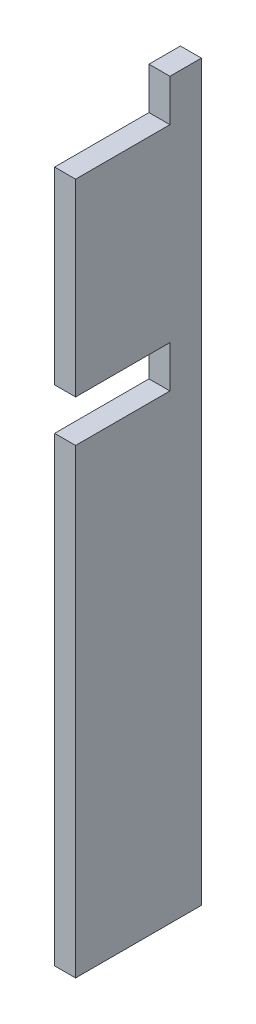
ISO-10303-21;
HEADER;
FILE_DESCRIPTION(('STEP AP214'),'2;1');
FILE_NAME('part.step','',(''),(''),'','','');
FILE_SCHEMA(('AUTOMOTIVE_DESIGN { 1 0 10303 214 1 1 1 1 }'));
ENDSEC;
DATA;
#1=APPLICATION_CONTEXT('core data for automotive mechanical design processes');
#2=APPLICATION_PROTOCOL_DEFINITION('international standard','automotive_design',2000,#1);
#3=PRODUCT_CONTEXT('',#1,'mechanical');
#4=PRODUCT('Part','Part','',(#3));
#5=PRODUCT_RELATED_PRODUCT_CATEGORY('part','',(#4));
#6=PRODUCT_DEFINITION_FORMATION('','',#4);
#7=PRODUCT_DEFINITION_CONTEXT('part definition',#1,'design');
#8=PRODUCT_DEFINITION('design','',#6,#7);
#9=PRODUCT_DEFINITION_SHAPE('','',#8);
#10=(LENGTH_UNIT() NAMED_UNIT(*) SI_UNIT(.MILLI.,.METRE.));
#11=(NAMED_UNIT(*) PLANE_ANGLE_UNIT() SI_UNIT($,.RADIAN.));
#12=(NAMED_UNIT(*) SI_UNIT($,.STERADIAN.) SOLID_ANGLE_UNIT());
#13=UNCERTAINTY_MEASURE_WITH_UNIT(LENGTH_MEASURE(1.E-05),#10,'distance_accuracy_value','');
#14=(GEOMETRIC_REPRESENTATION_CONTEXT(3) GLOBAL_UNCERTAINTY_ASSIGNED_CONTEXT((#13)) GLOBAL_UNIT_ASSIGNED_CONTEXT((#10,
#11,#12)) REPRESENTATION_CONTEXT('',''));
#15=CARTESIAN_POINT('',(0.,0.,0.));
#16=DIRECTION('',(0.,0.,1.));
#17=DIRECTION('',(1.,0.,0.));
#18=AXIS2_PLACEMENT_3D('',#15,#16,#17);
#19=CARTESIAN_POINT('',(1.5875,55.5625,9.52500000000001));
#20=DIRECTION('',(0.,0.,-1.));
#21=DIRECTION('',(0.,1.,0.));
#22=AXIS2_PLACEMENT_3D('',#19,#20,#21);
#23=PLANE('',#22);
#24=DIRECTION('',(0.,-1.,0.));
#25=VECTOR('',#24,1.);
#26=CARTESIAN_POINT('',(-1.5875,55.5625,9.52500000000001));
#27=LINE('',#26,#25);
#28=CARTESIAN_POINT('',(-1.5875,49.2125,9.52500000000001));
#29=VERTEX_POINT('',#28);
#30=CARTESIAN_POINT('',(-1.5875,20.6375,9.52500000000001));
#31=VERTEX_POINT('',#30);
#32=EDGE_CURVE('E131',#29,#31,#27,.T.);
#33=ORIENTED_EDGE('',*,*,#32,.T.);
#34=DIRECTION('',(1.,0.,0.));
#35=VECTOR('',#34,1.);
#36=CARTESIAN_POINT('',(-1.5875,20.6375,9.52500000000001));
#37=LINE('',#36,#35);
#38=CARTESIAN_POINT('',(1.5875,20.6375,9.52500000000001));
#39=VERTEX_POINT('',#38);
#40=EDGE_CURVE('E187',#31,#39,#37,.T.);
#41=ORIENTED_EDGE('',*,*,#40,.T.);
#42=DIRECTION('',(0.,-1.,0.));
#43=VECTOR('',#42,1.);
#44=CARTESIAN_POINT('',(1.5875,55.5625,9.52500000000001));
#45=LINE('',#44,#43);
#46=CARTESIAN_POINT('',(1.5875,49.2125,9.52500000000001));
#47=VERTEX_POINT('',#46);
#48=EDGE_CURVE('E152',#47,#39,#45,.T.);
#49=ORIENTED_EDGE('',*,*,#48,.F.);
#50=DIRECTION('',(1.,0.,0.));
#51=VECTOR('',#50,1.);
#52=CARTESIAN_POINT('',(-1.5875,49.2125,9.52500000000001));
#53=LINE('',#52,#51);
#54=EDGE_CURVE('E166',#29,#47,#53,.T.);
#55=ORIENTED_EDGE('',*,*,#54,.F.);
#56=EDGE_LOOP('',(#33,#41,#49,#55));
#57=FACE_BOUND('',#56,.T.);
#58=ADVANCED_FACE('F31',(#57),#23,.F.);
#59=CARTESIAN_POINT('',(1.5875,55.5625,-9.525));
#60=DIRECTION('',(0.,0.,1.));
#61=DIRECTION('',(0.,-1.,0.));
#62=AXIS2_PLACEMENT_3D('',#59,#60,#61);
#63=PLANE('',#62);
#64=DIRECTION('',(0.,1.,0.));
#65=VECTOR('',#64,1.);
#66=CARTESIAN_POINT('',(-1.5875,55.5625,-9.525));
#67=LINE('',#66,#65);
#68=CARTESIAN_POINT('',(-1.5875,-55.5625,-9.52500000000001));
#69=VERTEX_POINT('',#68);
#70=CARTESIAN_POINT('',(-1.5875,55.5625,-9.525));
#71=VERTEX_POINT('',#70);
#72=EDGE_CURVE('E136',#69,#71,#67,.T.);
#73=ORIENTED_EDGE('',*,*,#72,.T.);
#74=DIRECTION('',(-1.,0.,0.));
#75=VECTOR('',#74,1.);
#76=CARTESIAN_POINT('',(1.5875,55.5625,-9.525));
#77=LINE('',#76,#75);
#78=CARTESIAN_POINT('',(1.5875,55.5625,-9.525));
#79=VERTEX_POINT('',#78);
#80=EDGE_CURVE('E11',#79,#71,#77,.T.);
#81=ORIENTED_EDGE('',*,*,#80,.F.);
#82=DIRECTION('',(0.,1.,0.));
#83=VECTOR('',#82,1.);
#84=CARTESIAN_POINT('',(1.5875,55.5625,-9.525));
#85=LINE('',#84,#83);
#86=CARTESIAN_POINT('',(1.5875,-55.5625,-9.52500000000001));
#87=VERTEX_POINT('',#86);
#88=EDGE_CURVE('E141',#87,#79,#85,.T.);
#89=ORIENTED_EDGE('',*,*,#88,.F.);
#90=DIRECTION('',(-1.,0.,0.));
#91=VECTOR('',#90,1.);
#92=CARTESIAN_POINT('',(1.5875,-55.5625,-9.52500000000001));
#93=LINE('',#92,#91);
#94=EDGE_CURVE('E142',#87,#69,#93,.T.);
#95=ORIENTED_EDGE('',*,*,#94,.T.);
#96=EDGE_LOOP('',(#73,#81,#89,#95));
#97=FACE_BOUND('',#96,.T.);
#98=ADVANCED_FACE('F33',(#97),#63,.F.);
#99=CARTESIAN_POINT('',(1.5875,55.5625,9.52500000000001));
#100=DIRECTION('',(0.,-1.,0.));
#101=DIRECTION('',(0.,0.,-1.));
#102=AXIS2_PLACEMENT_3D('',#99,#100,#101);
#103=PLANE('',#102);
#104=DIRECTION('',(0.,0.,1.));
#105=VECTOR('',#104,1.);
#106=CARTESIAN_POINT('',(-1.5875,55.5625,9.52500000000001));
#107=LINE('',#106,#105);
#108=CARTESIAN_POINT('',(-1.5875,55.5625,-4.76249999999999));
#109=VERTEX_POINT('',#108);
#110=EDGE_CURVE('E132',#71,#109,#107,.T.);
#111=ORIENTED_EDGE('',*,*,#110,.T.);
#112=DIRECTION('',(1.,0.,0.));
#113=VECTOR('',#112,1.);
#114=CARTESIAN_POINT('',(-1.5875,55.5625,-4.76249999999999));
#115=LINE('',#114,#113);
#116=CARTESIAN_POINT('',(1.5875,55.5625,-4.76249999999999));
#117=VERTEX_POINT('',#116);
#118=EDGE_CURVE('E158',#109,#117,#115,.T.);
#119=ORIENTED_EDGE('',*,*,#118,.T.);
#120=DIRECTION('',(0.,0.,1.));
#121=VECTOR('',#120,1.);
#122=CARTESIAN_POINT('',(1.5875,55.5625,9.52500000000001));
#123=LINE('',#122,#121);
#124=EDGE_CURVE('E173',#79,#117,#123,.T.);
#125=ORIENTED_EDGE('',*,*,#124,.F.);
#126=ORIENTED_EDGE('',*,*,#80,.T.);
#127=EDGE_LOOP('',(#111,#119,#125,#126));
#128=FACE_BOUND('',#127,.T.);
#129=ADVANCED_FACE('F225',(#128),#103,.F.);
#130=CARTESIAN_POINT('',(1.5875,14.2875,9.525));
#131=VERTEX_POINT('',#130);
#132=CARTESIAN_POINT('',(1.5875,-55.5625,9.52499999999999));
#133=VERTEX_POINT('',#132);
#134=EDGE_CURVE('E124',#131,#133,#45,.T.);
#135=ORIENTED_EDGE('',*,*,#134,.F.);
#136=DIRECTION('',(1.,0.,0.));
#137=VECTOR('',#136,1.);
#138=CARTESIAN_POINT('',(-1.5875,14.2875,9.525));
#139=LINE('',#138,#137);
#140=CARTESIAN_POINT('',(-1.5875,14.2875,9.525));
#141=VERTEX_POINT('',#140);
#142=EDGE_CURVE('E111',#141,#131,#139,.T.);
#143=ORIENTED_EDGE('',*,*,#142,.F.);
#144=CARTESIAN_POINT('',(-1.5875,-55.5625,9.52499999999999));
#145=VERTEX_POINT('',#144);
#146=EDGE_CURVE('E122',#141,#145,#27,.T.);
#147=ORIENTED_EDGE('',*,*,#146,.T.);
#148=DIRECTION('',(-1.,0.,0.));
#149=VECTOR('',#148,1.);
#150=CARTESIAN_POINT('',(1.5875,-55.5625,9.52499999999999));
#151=LINE('',#150,#149);
#152=EDGE_CURVE('E39',#133,#145,#151,.T.);
#153=ORIENTED_EDGE('',*,*,#152,.F.);
#154=EDGE_LOOP('',(#135,#143,#147,#153));
#155=FACE_BOUND('',#154,.T.);
#156=ADVANCED_FACE('F120',(#155),#23,.F.);
#157=CARTESIAN_POINT('',(1.5875,-55.5625,9.52499999999999));
#158=DIRECTION('',(0.,1.,0.));
#159=DIRECTION('',(0.,0.,1.));
#160=AXIS2_PLACEMENT_3D('',#157,#158,#159);
#161=PLANE('',#160);
#162=DIRECTION('',(0.,0.,-1.));
#163=VECTOR('',#162,1.);
#164=CARTESIAN_POINT('',(-1.5875,-55.5625,9.52499999999999));
#165=LINE('',#164,#163);
#166=EDGE_CURVE('E130',#145,#69,#165,.T.);
#167=ORIENTED_EDGE('',*,*,#166,.T.);
#168=ORIENTED_EDGE('',*,*,#94,.F.);
#169=DIRECTION('',(0.,0.,-1.));
#170=VECTOR('',#169,1.);
#171=CARTESIAN_POINT('',(1.5875,-55.5625,9.52499999999999));
#172=LINE('',#171,#170);
#173=EDGE_CURVE('E144',#133,#87,#172,.T.);
#174=ORIENTED_EDGE('',*,*,#173,.F.);
#175=ORIENTED_EDGE('',*,*,#152,.T.);
#176=EDGE_LOOP('',(#167,#168,#174,#175));
#177=FACE_BOUND('',#176,.T.);
#178=ADVANCED_FACE('F147',(#177),#161,.F.);
#179=CARTESIAN_POINT('',(1.5875,-55.5625,-9.525));
#180=DIRECTION('',(1.,0.,0.));
#181=DIRECTION('',(0.,0.,-1.));
#182=AXIS2_PLACEMENT_3D('',#179,#180,#181);
#183=PLANE('',#182);
#184=DIRECTION('',(0.,0.,1.));
#185=VECTOR('',#184,1.);
#186=CARTESIAN_POINT('',(1.5875,20.6375,9.52500000000001));
#187=LINE('',#186,#185);
#188=CARTESIAN_POINT('',(1.5875,20.6375,-4.7625));
#189=VERTEX_POINT('',#188);
#190=EDGE_CURVE('E116',#189,#39,#187,.T.);
#191=ORIENTED_EDGE('',*,*,#190,.F.);
#192=DIRECTION('',(0.,1.,0.));
#193=VECTOR('',#192,1.);
#194=CARTESIAN_POINT('',(1.5875,20.6375,-4.7625));
#195=LINE('',#194,#193);
#196=CARTESIAN_POINT('',(1.5875,14.2875,-4.7625));
#197=VERTEX_POINT('',#196);
#198=EDGE_CURVE('E180',#197,#189,#195,.T.);
#199=ORIENTED_EDGE('',*,*,#198,.F.);
#200=DIRECTION('',(0.,0.,-1.));
#201=VECTOR('',#200,1.);
#202=CARTESIAN_POINT('',(1.5875,14.2875,9.525));
#203=LINE('',#202,#201);
#204=EDGE_CURVE('E178',#131,#197,#203,.T.);
#205=ORIENTED_EDGE('',*,*,#204,.F.);
#206=ORIENTED_EDGE('',*,*,#134,.T.);
#207=ORIENTED_EDGE('',*,*,#173,.T.);
#208=ORIENTED_EDGE('',*,*,#88,.T.);
#209=ORIENTED_EDGE('',*,*,#124,.T.);
#210=DIRECTION('',(0.,1.,0.));
#211=VECTOR('',#210,1.);
#212=CARTESIAN_POINT('',(1.5875,55.5625,-4.76249999999999));
#213=LINE('',#212,#211);
#214=CARTESIAN_POINT('',(1.5875,49.2125,-4.76249999999999));
#215=VERTEX_POINT('',#214);
#216=EDGE_CURVE('E169',#215,#117,#213,.T.);
#217=ORIENTED_EDGE('',*,*,#216,.F.);
#218=DIRECTION('',(0.,0.,-1.));
#219=VECTOR('',#218,1.);
#220=CARTESIAN_POINT('',(1.5875,49.2125,9.52500000000001));
#221=LINE('',#220,#219);
#222=EDGE_CURVE('E190',#47,#215,#221,.T.);
#223=ORIENTED_EDGE('',*,*,#222,.F.);
#224=ORIENTED_EDGE('',*,*,#48,.T.);
#225=EDGE_LOOP('',(#191,#199,#205,#206,#207,#208,#209,#217,#223,#224));
#226=FACE_BOUND('',#225,.T.);
#227=ADVANCED_FACE('F176',(#226),#183,.T.);
#228=CARTESIAN_POINT('',(-1.5875,-55.5625,-9.525));
#229=DIRECTION('',(1.,0.,0.));
#230=DIRECTION('',(0.,0.,-1.));
#231=AXIS2_PLACEMENT_3D('',#228,#229,#230);
#232=PLANE('',#231);
#233=DIRECTION('',(0.,1.,0.));
#234=VECTOR('',#233,1.);
#235=CARTESIAN_POINT('',(-1.5875,20.6375,-4.7625));
#236=LINE('',#235,#234);
#237=CARTESIAN_POINT('',(-1.5875,14.2875,-4.7625));
#238=VERTEX_POINT('',#237);
#239=CARTESIAN_POINT('',(-1.5875,20.6375,-4.7625));
#240=VERTEX_POINT('',#239);
#241=EDGE_CURVE('E46',#238,#240,#236,.T.);
#242=ORIENTED_EDGE('',*,*,#241,.T.);
#243=DIRECTION('',(0.,0.,1.));
#244=VECTOR('',#243,1.);
#245=CARTESIAN_POINT('',(-1.5875,20.6375,9.52500000000001));
#246=LINE('',#245,#244);
#247=EDGE_CURVE('E125',#240,#31,#246,.T.);
#248=ORIENTED_EDGE('',*,*,#247,.T.);
#249=ORIENTED_EDGE('',*,*,#32,.F.);
#250=DIRECTION('',(0.,0.,-1.));
#251=VECTOR('',#250,1.);
#252=CARTESIAN_POINT('',(-1.5875,49.2125,9.52500000000001));
#253=LINE('',#252,#251);
#254=CARTESIAN_POINT('',(-1.5875,49.2125,-4.76249999999999));
#255=VERTEX_POINT('',#254);
#256=EDGE_CURVE('E194',#29,#255,#253,.T.);
#257=ORIENTED_EDGE('',*,*,#256,.T.);
#258=DIRECTION('',(0.,1.,0.));
#259=VECTOR('',#258,1.);
#260=CARTESIAN_POINT('',(-1.5875,55.5625,-4.76249999999999));
#261=LINE('',#260,#259);
#262=EDGE_CURVE('E54',#255,#109,#261,.T.);
#263=ORIENTED_EDGE('',*,*,#262,.T.);
#264=ORIENTED_EDGE('',*,*,#110,.F.);
#265=ORIENTED_EDGE('',*,*,#72,.F.);
#266=ORIENTED_EDGE('',*,*,#166,.F.);
#267=ORIENTED_EDGE('',*,*,#146,.F.);
#268=DIRECTION('',(0.,0.,-1.));
#269=VECTOR('',#268,1.);
#270=CARTESIAN_POINT('',(-1.5875,14.2875,9.525));
#271=LINE('',#270,#269);
#272=EDGE_CURVE('E107',#141,#238,#271,.T.);
#273=ORIENTED_EDGE('',*,*,#272,.T.);
#274=EDGE_LOOP('',(#242,#248,#249,#257,#263,#264,#265,#266,#267,#273));
#275=FACE_BOUND('',#274,.T.);
#276=ADVANCED_FACE('F128',(#275),#232,.F.);
#277=CARTESIAN_POINT('',(-1.5875,55.5625,-4.76249999999999));
#278=DIRECTION('',(0.,0.,-1.));
#279=DIRECTION('',(-1.,0.,0.));
#280=AXIS2_PLACEMENT_3D('',#277,#278,#279);
#281=PLANE('',#280);
#282=ORIENTED_EDGE('',*,*,#216,.T.);
#283=ORIENTED_EDGE('',*,*,#118,.F.);
#284=ORIENTED_EDGE('',*,*,#262,.F.);
#285=DIRECTION('',(1.,0.,0.));
#286=VECTOR('',#285,1.);
#287=CARTESIAN_POINT('',(-1.5875,49.2125,-4.76249999999999));
#288=LINE('',#287,#286);
#289=EDGE_CURVE('E162',#255,#215,#288,.T.);
#290=ORIENTED_EDGE('',*,*,#289,.T.);
#291=EDGE_LOOP('',(#282,#283,#284,#290));
#292=FACE_BOUND('',#291,.T.);
#293=ADVANCED_FACE('F200',(#292),#281,.F.);
#294=CARTESIAN_POINT('',(-1.5875,49.2125,9.52500000000001));
#295=DIRECTION('',(0.,-1.,0.));
#296=DIRECTION('',(0.,0.,-1.));
#297=AXIS2_PLACEMENT_3D('',#294,#295,#296);
#298=PLANE('',#297);
#299=ORIENTED_EDGE('',*,*,#222,.T.);
#300=ORIENTED_EDGE('',*,*,#289,.F.);
#301=ORIENTED_EDGE('',*,*,#256,.F.);
#302=ORIENTED_EDGE('',*,*,#54,.T.);
#303=EDGE_LOOP('',(#299,#300,#301,#302));
#304=FACE_BOUND('',#303,.T.);
#305=ADVANCED_FACE('F209',(#304),#298,.F.);
#306=CARTESIAN_POINT('',(-1.5875,20.6375,9.52500000000001));
#307=DIRECTION('',(0.,1.,0.));
#308=DIRECTION('',(0.,0.,1.));
#309=AXIS2_PLACEMENT_3D('',#306,#307,#308);
#310=PLANE('',#309);
#311=ORIENTED_EDGE('',*,*,#190,.T.);
#312=ORIENTED_EDGE('',*,*,#40,.F.);
#313=ORIENTED_EDGE('',*,*,#247,.F.);
#314=DIRECTION('',(1.,0.,0.));
#315=VECTOR('',#314,1.);
#316=CARTESIAN_POINT('',(-1.5875,20.6375,-4.7625));
#317=LINE('',#316,#315);
#318=EDGE_CURVE('E191',#240,#189,#317,.T.);
#319=ORIENTED_EDGE('',*,*,#318,.T.);
#320=EDGE_LOOP('',(#311,#312,#313,#319));
#321=FACE_BOUND('',#320,.T.);
#322=ADVANCED_FACE('F208',(#321),#310,.F.);
#323=CARTESIAN_POINT('',(-1.5875,20.6375,-4.7625));
#324=DIRECTION('',(0.,0.,-1.));
#325=DIRECTION('',(0.,1.,0.));
#326=AXIS2_PLACEMENT_3D('',#323,#324,#325);
#327=PLANE('',#326);
#328=ORIENTED_EDGE('',*,*,#198,.T.);
#329=ORIENTED_EDGE('',*,*,#318,.F.);
#330=ORIENTED_EDGE('',*,*,#241,.F.);
#331=DIRECTION('',(1.,0.,0.));
#332=VECTOR('',#331,1.);
#333=CARTESIAN_POINT('',(-1.5875,14.2875,-4.7625));
#334=LINE('',#333,#332);
#335=EDGE_CURVE('E113',#238,#197,#334,.T.);
#336=ORIENTED_EDGE('',*,*,#335,.T.);
#337=EDGE_LOOP('',(#328,#329,#330,#336));
#338=FACE_BOUND('',#337,.T.);
#339=ADVANCED_FACE('F216',(#338),#327,.F.);
#340=CARTESIAN_POINT('',(-1.5875,14.2875,9.525));
#341=DIRECTION('',(0.,-1.,0.));
#342=DIRECTION('',(0.,0.,-1.));
#343=AXIS2_PLACEMENT_3D('',#340,#341,#342);
#344=PLANE('',#343);
#345=ORIENTED_EDGE('',*,*,#204,.T.);
#346=ORIENTED_EDGE('',*,*,#335,.F.);
#347=ORIENTED_EDGE('',*,*,#272,.F.);
#348=ORIENTED_EDGE('',*,*,#142,.T.);
#349=EDGE_LOOP('',(#345,#346,#347,#348));
#350=FACE_BOUND('',#349,.T.);
#351=ADVANCED_FACE('F110',(#350),#344,.F.);
#352=CLOSED_SHELL('',(#58,#98,#129,#156,#178,#227,#276,#293,#305,#322,#339,#351));
#353=MANIFOLD_SOLID_BREP('B2',#352);
#354=ADVANCED_BREP_SHAPE_REPRESENTATION('',(#18,#353),#14);
#355=SHAPE_DEFINITION_REPRESENTATION(#9,#354);
ENDSEC;
END-ISO-10303-21;
